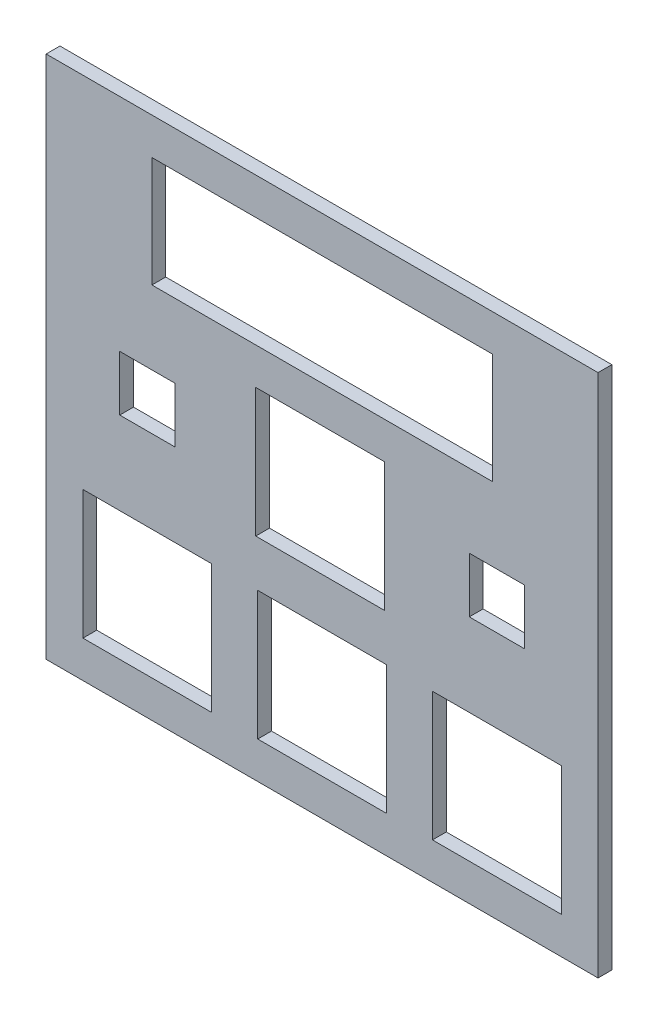
ISO-10303-21;
HEADER;
FILE_DESCRIPTION(('STEP AP214'),'2;1');
FILE_NAME('part.step','',(''),(''),'','','');
FILE_SCHEMA(('AUTOMOTIVE_DESIGN { 1 0 10303 214 1 1 1 1 }'));
ENDSEC;
DATA;
#1=APPLICATION_CONTEXT('core data for automotive mechanical design processes');
#2=APPLICATION_PROTOCOL_DEFINITION('international standard','automotive_design',2000,#1);
#3=PRODUCT_CONTEXT('',#1,'mechanical');
#4=PRODUCT('Part','Part','',(#3));
#5=PRODUCT_RELATED_PRODUCT_CATEGORY('part','',(#4));
#6=PRODUCT_DEFINITION_FORMATION('','',#4);
#7=PRODUCT_DEFINITION_CONTEXT('part definition',#1,'design');
#8=PRODUCT_DEFINITION('design','',#6,#7);
#9=PRODUCT_DEFINITION_SHAPE('','',#8);
#10=(LENGTH_UNIT() NAMED_UNIT(*) SI_UNIT(.MILLI.,.METRE.));
#11=(NAMED_UNIT(*) PLANE_ANGLE_UNIT() SI_UNIT($,.RADIAN.));
#12=(NAMED_UNIT(*) SI_UNIT($,.STERADIAN.) SOLID_ANGLE_UNIT());
#13=UNCERTAINTY_MEASURE_WITH_UNIT(LENGTH_MEASURE(1.E-05),#10,'distance_accuracy_value','');
#14=(GEOMETRIC_REPRESENTATION_CONTEXT(3) GLOBAL_UNCERTAINTY_ASSIGNED_CONTEXT((#13)) GLOBAL_UNIT_ASSIGNED_CONTEXT((#10,
#11,#12)) REPRESENTATION_CONTEXT('',''));
#15=CARTESIAN_POINT('',(0.,0.,0.));
#16=DIRECTION('',(0.,0.,1.));
#17=DIRECTION('',(1.,0.,0.));
#18=AXIS2_PLACEMENT_3D('',#15,#16,#17);
#19=CARTESIAN_POINT('',(0.,0.,1.5));
#20=DIRECTION('',(0.,0.,1.));
#21=DIRECTION('',(1.,0.,0.));
#22=AXIS2_PLACEMENT_3D('',#19,#20,#21);
#23=PLANE('',#22);
#24=DIRECTION('',(0.,-1.,0.));
#25=VECTOR('',#24,1.);
#26=CARTESIAN_POINT('',(-29.7000317126136,15.8414634146342,1.5));
#27=LINE('',#26,#25);
#28=CARTESIAN_POINT('',(-29.7000317126136,15.8414634146342,1.5));
#29=VERTEX_POINT('',#28);
#30=CARTESIAN_POINT('',(-29.7000317126135,-41.1585365853659,1.5));
#31=VERTEX_POINT('',#30);
#32=EDGE_CURVE('E464',#29,#31,#27,.T.);
#33=ORIENTED_EDGE('',*,*,#32,.T.);
#34=DIRECTION('',(1.,0.,0.));
#35=VECTOR('',#34,1.);
#36=CARTESIAN_POINT('',(-29.7000317126135,-41.1585365853659,1.5));
#37=LINE('',#36,#35);
#38=CARTESIAN_POINT('',(30.2999682873865,-41.1585365853658,1.5));
#39=VERTEX_POINT('',#38);
#40=EDGE_CURVE('E467',#31,#39,#37,.T.);
#41=ORIENTED_EDGE('',*,*,#40,.T.);
#42=DIRECTION('',(0.,1.,0.));
#43=VECTOR('',#42,1.);
#44=CARTESIAN_POINT('',(30.2999682873864,15.8414634146342,1.5));
#45=LINE('',#44,#43);
#46=CARTESIAN_POINT('',(30.2999682873864,15.8414634146342,1.5));
#47=VERTEX_POINT('',#46);
#48=EDGE_CURVE('E470',#39,#47,#45,.T.);
#49=ORIENTED_EDGE('',*,*,#48,.T.);
#50=DIRECTION('',(-1.,0.,0.));
#51=VECTOR('',#50,1.);
#52=CARTESIAN_POINT('',(-29.7000317126136,15.8414634146342,1.5));
#53=LINE('',#52,#51);
#54=EDGE_CURVE('E472',#47,#29,#53,.T.);
#55=ORIENTED_EDGE('',*,*,#54,.T.);
#56=EDGE_LOOP('',(#33,#41,#49,#55));
#57=FACE_BOUND('',#56,.T.);
#58=DIRECTION('',(1.,0.,0.));
#59=VECTOR('',#58,1.);
#60=CARTESIAN_POINT('',(-25.7000317126136,-37.1585365853658,1.5));
#61=LINE('',#60,#59);
#62=CARTESIAN_POINT('',(-25.7000317126136,-37.1585365853658,1.5));
#63=VERTEX_POINT('',#62);
#64=CARTESIAN_POINT('',(-11.7000317126135,-37.1585365853658,1.5));
#65=VERTEX_POINT('',#64);
#66=EDGE_CURVE('E435',#63,#65,#61,.T.);
#67=ORIENTED_EDGE('',*,*,#66,.F.);
#68=DIRECTION('',(0.,-1.,0.));
#69=VECTOR('',#68,1.);
#70=CARTESIAN_POINT('',(-25.7000317126136,-37.1585365853658,1.5));
#71=LINE('',#70,#69);
#72=CARTESIAN_POINT('',(-25.7000317126136,-23.1585365853658,1.5));
#73=VERTEX_POINT('',#72);
#74=EDGE_CURVE('E433',#73,#63,#71,.T.);
#75=ORIENTED_EDGE('',*,*,#74,.F.);
#76=DIRECTION('',(-1.,0.,0.));
#77=VECTOR('',#76,1.);
#78=CARTESIAN_POINT('',(-25.7000317126136,-23.1585365853658,1.5));
#79=LINE('',#78,#77);
#80=CARTESIAN_POINT('',(-11.7000317126135,-23.1585365853658,1.5));
#81=VERTEX_POINT('',#80);
#82=EDGE_CURVE('E441',#81,#73,#79,.T.);
#83=ORIENTED_EDGE('',*,*,#82,.F.);
#84=DIRECTION('',(0.,1.,0.));
#85=VECTOR('',#84,1.);
#86=CARTESIAN_POINT('',(-11.7000317126135,-37.1585365853658,1.5));
#87=LINE('',#86,#85);
#88=EDGE_CURVE('E438',#65,#81,#87,.T.);
#89=ORIENTED_EDGE('',*,*,#88,.F.);
#90=EDGE_LOOP('',(#67,#75,#83,#89));
#91=FACE_BOUND('',#90,.T.);
#92=DIRECTION('',(1.,0.,0.));
#93=VECTOR('',#92,1.);
#94=CARTESIAN_POINT('',(-6.70003171261355,-37.1585365853658,1.5));
#95=LINE('',#94,#93);
#96=CARTESIAN_POINT('',(-6.70003171261355,-37.1585365853658,1.5));
#97=VERTEX_POINT('',#96);
#98=CARTESIAN_POINT('',(7.29996828738645,-37.1585365853658,1.5));
#99=VERTEX_POINT('',#98);
#100=EDGE_CURVE('E404',#97,#99,#95,.T.);
#101=ORIENTED_EDGE('',*,*,#100,.F.);
#102=DIRECTION('',(0.,-1.,0.));
#103=VECTOR('',#102,1.);
#104=CARTESIAN_POINT('',(-6.70003171261355,-37.1585365853658,1.5));
#105=LINE('',#104,#103);
#106=CARTESIAN_POINT('',(-6.70003171261355,-23.1585365853658,1.5));
#107=VERTEX_POINT('',#106);
#108=EDGE_CURVE('E402',#107,#97,#105,.T.);
#109=ORIENTED_EDGE('',*,*,#108,.F.);
#110=DIRECTION('',(-1.,0.,0.));
#111=VECTOR('',#110,1.);
#112=CARTESIAN_POINT('',(-6.70003171261355,-23.1585365853658,1.5));
#113=LINE('',#112,#111);
#114=CARTESIAN_POINT('',(7.29996828738645,-23.1585365853658,1.5));
#115=VERTEX_POINT('',#114);
#116=EDGE_CURVE('E410',#115,#107,#113,.T.);
#117=ORIENTED_EDGE('',*,*,#116,.F.);
#118=DIRECTION('',(0.,1.,0.));
#119=VECTOR('',#118,1.);
#120=CARTESIAN_POINT('',(7.29996828738645,-37.1585365853658,1.5));
#121=LINE('',#120,#119);
#122=EDGE_CURVE('E407',#99,#115,#121,.T.);
#123=ORIENTED_EDGE('',*,*,#122,.F.);
#124=EDGE_LOOP('',(#101,#109,#117,#123));
#125=FACE_BOUND('',#124,.T.);
#126=DIRECTION('',(1.,0.,0.));
#127=VECTOR('',#126,1.);
#128=CARTESIAN_POINT('',(12.2999682873865,-37.1585365853659,1.5));
#129=LINE('',#128,#127);
#130=CARTESIAN_POINT('',(12.2999682873865,-37.1585365853659,1.5));
#131=VERTEX_POINT('',#130);
#132=CARTESIAN_POINT('',(26.2999682873865,-37.1585365853659,1.5));
#133=VERTEX_POINT('',#132);
#134=EDGE_CURVE('E373',#131,#133,#129,.T.);
#135=ORIENTED_EDGE('',*,*,#134,.F.);
#136=DIRECTION('',(0.,-1.,0.));
#137=VECTOR('',#136,1.);
#138=CARTESIAN_POINT('',(12.2999682873865,-23.1585365853659,1.5));
#139=LINE('',#138,#137);
#140=CARTESIAN_POINT('',(12.2999682873865,-23.1585365853659,1.5));
#141=VERTEX_POINT('',#140);
#142=EDGE_CURVE('E371',#141,#131,#139,.T.);
#143=ORIENTED_EDGE('',*,*,#142,.F.);
#144=DIRECTION('',(-1.,0.,0.));
#145=VECTOR('',#144,1.);
#146=CARTESIAN_POINT('',(12.2999682873865,-23.1585365853659,1.5));
#147=LINE('',#146,#145);
#148=CARTESIAN_POINT('',(26.2999682873865,-23.1585365853659,1.5));
#149=VERTEX_POINT('',#148);
#150=EDGE_CURVE('E379',#149,#141,#147,.T.);
#151=ORIENTED_EDGE('',*,*,#150,.F.);
#152=DIRECTION('',(0.,1.,0.));
#153=VECTOR('',#152,1.);
#154=CARTESIAN_POINT('',(26.2999682873865,-23.1585365853659,1.5));
#155=LINE('',#154,#153);
#156=EDGE_CURVE('E376',#133,#149,#155,.T.);
#157=ORIENTED_EDGE('',*,*,#156,.F.);
#158=EDGE_LOOP('',(#135,#143,#151,#157));
#159=FACE_BOUND('',#158,.T.);
#160=DIRECTION('',(1.,0.,0.));
#161=VECTOR('',#160,1.);
#162=CARTESIAN_POINT('',(-6.91472683456475,-18.1585365853658,1.5));
#163=LINE('',#162,#161);
#164=CARTESIAN_POINT('',(-6.91472683456475,-18.1585365853658,1.5));
#165=VERTEX_POINT('',#164);
#166=CARTESIAN_POINT('',(7.08527316543525,-18.1585365853658,1.5));
#167=VERTEX_POINT('',#166);
#168=EDGE_CURVE('E342',#165,#167,#163,.T.);
#169=ORIENTED_EDGE('',*,*,#168,.F.);
#170=DIRECTION('',(0.,-1.,0.));
#171=VECTOR('',#170,1.);
#172=CARTESIAN_POINT('',(-6.91472683456475,-18.1585365853658,1.5));
#173=LINE('',#172,#171);
#174=CARTESIAN_POINT('',(-6.91472683456475,-4.15853658536585,1.5));
#175=VERTEX_POINT('',#174);
#176=EDGE_CURVE('E340',#175,#165,#173,.T.);
#177=ORIENTED_EDGE('',*,*,#176,.F.);
#178=DIRECTION('',(-1.,0.,0.));
#179=VECTOR('',#178,1.);
#180=CARTESIAN_POINT('',(-6.91472683456475,-4.15853658536585,1.5));
#181=LINE('',#180,#179);
#182=CARTESIAN_POINT('',(7.08527316543525,-4.15853658536585,1.5));
#183=VERTEX_POINT('',#182);
#184=EDGE_CURVE('E348',#183,#175,#181,.T.);
#185=ORIENTED_EDGE('',*,*,#184,.F.);
#186=DIRECTION('',(0.,1.,0.));
#187=VECTOR('',#186,1.);
#188=CARTESIAN_POINT('',(7.08527316543525,-18.1585365853658,1.5));
#189=LINE('',#188,#187);
#190=EDGE_CURVE('E345',#167,#183,#189,.T.);
#191=ORIENTED_EDGE('',*,*,#190,.F.);
#192=EDGE_LOOP('',(#169,#177,#185,#191));
#193=FACE_BOUND('',#192,.T.);
#194=DIRECTION('',(1.,0.,0.));
#195=VECTOR('',#194,1.);
#196=CARTESIAN_POINT('',(-18.2000317126136,-0.158536585365847,1.5));
#197=LINE('',#196,#195);
#198=CARTESIAN_POINT('',(-18.2000317126136,-0.158536585365847,1.5));
#199=VERTEX_POINT('',#198);
#200=CARTESIAN_POINT('',(18.7999682873865,-0.158536585365847,1.5));
#201=VERTEX_POINT('',#200);
#202=EDGE_CURVE('E311',#199,#201,#197,.T.);
#203=ORIENTED_EDGE('',*,*,#202,.F.);
#204=DIRECTION('',(0.,-1.,0.));
#205=VECTOR('',#204,1.);
#206=CARTESIAN_POINT('',(-18.2000317126136,11.8414634146342,1.5));
#207=LINE('',#206,#205);
#208=CARTESIAN_POINT('',(-18.2000317126136,11.8414634146342,1.5));
#209=VERTEX_POINT('',#208);
#210=EDGE_CURVE('E309',#209,#199,#207,.T.);
#211=ORIENTED_EDGE('',*,*,#210,.F.);
#212=DIRECTION('',(-1.,0.,0.));
#213=VECTOR('',#212,1.);
#214=CARTESIAN_POINT('',(-18.2000317126136,11.8414634146342,1.5));
#215=LINE('',#214,#213);
#216=CARTESIAN_POINT('',(18.7999682873864,11.8414634146342,1.5));
#217=VERTEX_POINT('',#216);
#218=EDGE_CURVE('E317',#217,#209,#215,.T.);
#219=ORIENTED_EDGE('',*,*,#218,.F.);
#220=DIRECTION('',(0.,1.,0.));
#221=VECTOR('',#220,1.);
#222=CARTESIAN_POINT('',(18.7999682873864,11.8414634146342,1.5));
#223=LINE('',#222,#221);
#224=EDGE_CURVE('E314',#201,#217,#223,.T.);
#225=ORIENTED_EDGE('',*,*,#224,.F.);
#226=EDGE_LOOP('',(#203,#211,#219,#225));
#227=FACE_BOUND('',#226,.T.);
#228=DIRECTION('',(1.,0.,0.));
#229=VECTOR('',#228,1.);
#230=CARTESIAN_POINT('',(-21.7000317126135,-14.1585365853658,1.5));
#231=LINE('',#230,#229);
#232=CARTESIAN_POINT('',(-21.7000317126135,-14.1585365853658,1.5));
#233=VERTEX_POINT('',#232);
#234=CARTESIAN_POINT('',(-15.7000317126135,-14.1585365853658,1.5));
#235=VERTEX_POINT('',#234);
#236=EDGE_CURVE('E280',#233,#235,#231,.T.);
#237=ORIENTED_EDGE('',*,*,#236,.F.);
#238=DIRECTION('',(0.,-1.,0.));
#239=VECTOR('',#238,1.);
#240=CARTESIAN_POINT('',(-21.7000317126135,-8.15853658536584,1.5));
#241=LINE('',#240,#239);
#242=CARTESIAN_POINT('',(-21.7000317126135,-8.15853658536584,1.5));
#243=VERTEX_POINT('',#242);
#244=EDGE_CURVE('E278',#243,#233,#241,.T.);
#245=ORIENTED_EDGE('',*,*,#244,.F.);
#246=DIRECTION('',(-1.,0.,0.));
#247=VECTOR('',#246,1.);
#248=CARTESIAN_POINT('',(-21.7000317126135,-8.15853658536584,1.5));
#249=LINE('',#248,#247);
#250=CARTESIAN_POINT('',(-15.7000317126135,-8.15853658536584,1.5));
#251=VERTEX_POINT('',#250);
#252=EDGE_CURVE('E286',#251,#243,#249,.T.);
#253=ORIENTED_EDGE('',*,*,#252,.F.);
#254=DIRECTION('',(0.,1.,0.));
#255=VECTOR('',#254,1.);
#256=CARTESIAN_POINT('',(-15.7000317126135,-8.15853658536584,1.5));
#257=LINE('',#256,#255);
#258=EDGE_CURVE('E283',#235,#251,#257,.T.);
#259=ORIENTED_EDGE('',*,*,#258,.F.);
#260=EDGE_LOOP('',(#237,#245,#253,#259));
#261=FACE_BOUND('',#260,.T.);
#262=DIRECTION('',(1.,0.,0.));
#263=VECTOR('',#262,1.);
#264=CARTESIAN_POINT('',(16.2999682873865,-14.1585365853658,1.5));
#265=LINE('',#264,#263);
#266=CARTESIAN_POINT('',(16.2999682873865,-14.1585365853658,1.5));
#267=VERTEX_POINT('',#266);
#268=CARTESIAN_POINT('',(22.2999682873865,-14.1585365853658,1.5));
#269=VERTEX_POINT('',#268);
#270=EDGE_CURVE('E250',#267,#269,#265,.T.);
#271=ORIENTED_EDGE('',*,*,#270,.F.);
#272=DIRECTION('',(0.,-1.,0.));
#273=VECTOR('',#272,1.);
#274=CARTESIAN_POINT('',(16.2999682873865,-14.1585365853658,1.5));
#275=LINE('',#274,#273);
#276=CARTESIAN_POINT('',(16.2999682873865,-8.15853658536584,1.5));
#277=VERTEX_POINT('',#276);
#278=EDGE_CURVE('E242',#277,#267,#275,.T.);
#279=ORIENTED_EDGE('',*,*,#278,.F.);
#280=DIRECTION('',(-1.,0.,0.));
#281=VECTOR('',#280,1.);
#282=CARTESIAN_POINT('',(16.2999682873865,-8.15853658536584,1.5));
#283=LINE('',#282,#281);
#284=CARTESIAN_POINT('',(22.2999682873865,-8.15853658536584,1.5));
#285=VERTEX_POINT('',#284);
#286=EDGE_CURVE('E264',#285,#277,#283,.T.);
#287=ORIENTED_EDGE('',*,*,#286,.F.);
#288=DIRECTION('',(0.,1.,0.));
#289=VECTOR('',#288,1.);
#290=CARTESIAN_POINT('',(22.2999682873865,-14.1585365853658,1.5));
#291=LINE('',#290,#289);
#292=EDGE_CURVE('E262',#269,#285,#291,.T.);
#293=ORIENTED_EDGE('',*,*,#292,.F.);
#294=EDGE_LOOP('',(#271,#279,#287,#293));
#295=FACE_BOUND('',#294,.T.);
#296=ADVANCED_FACE('F33',(#57,#91,#125,#159,#193,#227,#261,#295),#23,.T.);
#297=CARTESIAN_POINT('',(0.,0.,0.));
#298=DIRECTION('',(0.,0.,1.));
#299=DIRECTION('',(1.,0.,0.));
#300=AXIS2_PLACEMENT_3D('',#297,#298,#299);
#301=PLANE('',#300);
#302=DIRECTION('',(0.,-1.,0.));
#303=VECTOR('',#302,1.);
#304=CARTESIAN_POINT('',(-21.7000317126135,-8.15853658536584,0.));
#305=LINE('',#304,#303);
#306=CARTESIAN_POINT('',(-21.7000317126135,-8.15853658536584,0.));
#307=VERTEX_POINT('',#306);
#308=CARTESIAN_POINT('',(-21.7000317126135,-14.1585365853658,0.));
#309=VERTEX_POINT('',#308);
#310=EDGE_CURVE('E258',#307,#309,#305,.T.);
#311=ORIENTED_EDGE('',*,*,#310,.T.);
#312=DIRECTION('',(1.,0.,0.));
#313=VECTOR('',#312,1.);
#314=CARTESIAN_POINT('',(-21.7000317126135,-14.1585365853658,0.));
#315=LINE('',#314,#313);
#316=CARTESIAN_POINT('',(-15.7000317126135,-14.1585365853658,0.));
#317=VERTEX_POINT('',#316);
#318=EDGE_CURVE('E291',#309,#317,#315,.T.);
#319=ORIENTED_EDGE('',*,*,#318,.T.);
#320=DIRECTION('',(0.,1.,0.));
#321=VECTOR('',#320,1.);
#322=CARTESIAN_POINT('',(-15.7000317126135,-8.15853658536584,0.));
#323=LINE('',#322,#321);
#324=CARTESIAN_POINT('',(-15.7000317126135,-8.15853658536584,0.));
#325=VERTEX_POINT('',#324);
#326=EDGE_CURVE('E294',#317,#325,#323,.T.);
#327=ORIENTED_EDGE('',*,*,#326,.T.);
#328=DIRECTION('',(-1.,0.,0.));
#329=VECTOR('',#328,1.);
#330=CARTESIAN_POINT('',(-21.7000317126135,-8.15853658536584,0.));
#331=LINE('',#330,#329);
#332=EDGE_CURVE('E281',#325,#307,#331,.T.);
#333=ORIENTED_EDGE('',*,*,#332,.T.);
#334=EDGE_LOOP('',(#311,#319,#327,#333));
#335=FACE_BOUND('',#334,.T.);
#336=DIRECTION('',(0.,-1.,0.));
#337=VECTOR('',#336,1.);
#338=CARTESIAN_POINT('',(-6.91472683456475,-18.1585365853658,0.));
#339=LINE('',#338,#337);
#340=CARTESIAN_POINT('',(-6.91472683456475,-4.15853658536585,0.));
#341=VERTEX_POINT('',#340);
#342=CARTESIAN_POINT('',(-6.91472683456475,-18.1585365853658,0.));
#343=VERTEX_POINT('',#342);
#344=EDGE_CURVE('E339',#341,#343,#339,.T.);
#345=ORIENTED_EDGE('',*,*,#344,.T.);
#346=DIRECTION('',(1.,0.,0.));
#347=VECTOR('',#346,1.);
#348=CARTESIAN_POINT('',(-6.91472683456475,-18.1585365853658,0.));
#349=LINE('',#348,#347);
#350=CARTESIAN_POINT('',(7.08527316543525,-18.1585365853658,0.));
#351=VERTEX_POINT('',#350);
#352=EDGE_CURVE('E353',#343,#351,#349,.T.);
#353=ORIENTED_EDGE('',*,*,#352,.T.);
#354=DIRECTION('',(0.,1.,0.));
#355=VECTOR('',#354,1.);
#356=CARTESIAN_POINT('',(7.08527316543525,-18.1585365853658,0.));
#357=LINE('',#356,#355);
#358=CARTESIAN_POINT('',(7.08527316543525,-4.15853658536585,0.));
#359=VERTEX_POINT('',#358);
#360=EDGE_CURVE('E356',#351,#359,#357,.T.);
#361=ORIENTED_EDGE('',*,*,#360,.T.);
#362=DIRECTION('',(-1.,0.,0.));
#363=VECTOR('',#362,1.);
#364=CARTESIAN_POINT('',(-6.91472683456475,-4.15853658536585,0.));
#365=LINE('',#364,#363);
#366=EDGE_CURVE('E343',#359,#341,#365,.T.);
#367=ORIENTED_EDGE('',*,*,#366,.T.);
#368=EDGE_LOOP('',(#345,#353,#361,#367));
#369=FACE_BOUND('',#368,.T.);
#370=DIRECTION('',(0.,-1.,0.));
#371=VECTOR('',#370,1.);
#372=CARTESIAN_POINT('',(-6.70003171261355,-37.1585365853658,0.));
#373=LINE('',#372,#371);
#374=CARTESIAN_POINT('',(-6.70003171261355,-23.1585365853658,0.));
#375=VERTEX_POINT('',#374);
#376=CARTESIAN_POINT('',(-6.70003171261355,-37.1585365853658,0.));
#377=VERTEX_POINT('',#376);
#378=EDGE_CURVE('E401',#375,#377,#373,.T.);
#379=ORIENTED_EDGE('',*,*,#378,.T.);
#380=DIRECTION('',(1.,0.,0.));
#381=VECTOR('',#380,1.);
#382=CARTESIAN_POINT('',(-6.70003171261355,-37.1585365853658,0.));
#383=LINE('',#382,#381);
#384=CARTESIAN_POINT('',(7.29996828738645,-37.1585365853658,0.));
#385=VERTEX_POINT('',#384);
#386=EDGE_CURVE('E415',#377,#385,#383,.T.);
#387=ORIENTED_EDGE('',*,*,#386,.T.);
#388=DIRECTION('',(0.,1.,0.));
#389=VECTOR('',#388,1.);
#390=CARTESIAN_POINT('',(7.29996828738645,-37.1585365853658,0.));
#391=LINE('',#390,#389);
#392=CARTESIAN_POINT('',(7.29996828738645,-23.1585365853658,0.));
#393=VERTEX_POINT('',#392);
#394=EDGE_CURVE('E418',#385,#393,#391,.T.);
#395=ORIENTED_EDGE('',*,*,#394,.T.);
#396=DIRECTION('',(-1.,0.,0.));
#397=VECTOR('',#396,1.);
#398=CARTESIAN_POINT('',(-6.70003171261355,-23.1585365853658,0.));
#399=LINE('',#398,#397);
#400=EDGE_CURVE('E405',#393,#375,#399,.T.);
#401=ORIENTED_EDGE('',*,*,#400,.T.);
#402=EDGE_LOOP('',(#379,#387,#395,#401));
#403=FACE_BOUND('',#402,.T.);
#404=DIRECTION('',(0.,-1.,0.));
#405=VECTOR('',#404,1.);
#406=CARTESIAN_POINT('',(-29.7000317126136,15.8414634146342,0.));
#407=LINE('',#406,#405);
#408=CARTESIAN_POINT('',(-29.7000317126136,15.8414634146342,0.));
#409=VERTEX_POINT('',#408);
#410=CARTESIAN_POINT('',(-29.7000317126135,-41.1585365853659,0.));
#411=VERTEX_POINT('',#410);
#412=EDGE_CURVE('E463',#409,#411,#407,.T.);
#413=ORIENTED_EDGE('',*,*,#412,.F.);
#414=DIRECTION('',(-1.,0.,0.));
#415=VECTOR('',#414,1.);
#416=CARTESIAN_POINT('',(-29.7000317126136,15.8414634146342,0.));
#417=LINE('',#416,#415);
#418=CARTESIAN_POINT('',(30.2999682873864,15.8414634146342,0.));
#419=VERTEX_POINT('',#418);
#420=EDGE_CURVE('E468',#419,#409,#417,.T.);
#421=ORIENTED_EDGE('',*,*,#420,.F.);
#422=DIRECTION('',(0.,1.,0.));
#423=VECTOR('',#422,1.);
#424=CARTESIAN_POINT('',(30.2999682873864,15.8414634146342,0.));
#425=LINE('',#424,#423);
#426=CARTESIAN_POINT('',(30.2999682873865,-41.1585365853658,0.));
#427=VERTEX_POINT('',#426);
#428=EDGE_CURVE('E479',#427,#419,#425,.T.);
#429=ORIENTED_EDGE('',*,*,#428,.F.);
#430=DIRECTION('',(1.,0.,0.));
#431=VECTOR('',#430,1.);
#432=CARTESIAN_POINT('',(-29.7000317126135,-41.1585365853659,0.));
#433=LINE('',#432,#431);
#434=EDGE_CURVE('E477',#411,#427,#433,.T.);
#435=ORIENTED_EDGE('',*,*,#434,.F.);
#436=EDGE_LOOP('',(#413,#421,#429,#435));
#437=FACE_BOUND('',#436,.T.);
#438=DIRECTION('',(0.,-1.,0.));
#439=VECTOR('',#438,1.);
#440=CARTESIAN_POINT('',(-25.7000317126136,-37.1585365853658,0.));
#441=LINE('',#440,#439);
#442=CARTESIAN_POINT('',(-25.7000317126136,-23.1585365853658,0.));
#443=VERTEX_POINT('',#442);
#444=CARTESIAN_POINT('',(-25.7000317126136,-37.1585365853658,0.));
#445=VERTEX_POINT('',#444);
#446=EDGE_CURVE('E432',#443,#445,#441,.T.);
#447=ORIENTED_EDGE('',*,*,#446,.T.);
#448=DIRECTION('',(1.,0.,0.));
#449=VECTOR('',#448,1.);
#450=CARTESIAN_POINT('',(-25.7000317126136,-37.1585365853658,0.));
#451=LINE('',#450,#449);
#452=CARTESIAN_POINT('',(-11.7000317126135,-37.1585365853658,0.));
#453=VERTEX_POINT('',#452);
#454=EDGE_CURVE('E446',#445,#453,#451,.T.);
#455=ORIENTED_EDGE('',*,*,#454,.T.);
#456=DIRECTION('',(0.,1.,0.));
#457=VECTOR('',#456,1.);
#458=CARTESIAN_POINT('',(-11.7000317126135,-37.1585365853658,0.));
#459=LINE('',#458,#457);
#460=CARTESIAN_POINT('',(-11.7000317126135,-23.1585365853658,0.));
#461=VERTEX_POINT('',#460);
#462=EDGE_CURVE('E449',#453,#461,#459,.T.);
#463=ORIENTED_EDGE('',*,*,#462,.T.);
#464=DIRECTION('',(-1.,0.,0.));
#465=VECTOR('',#464,1.);
#466=CARTESIAN_POINT('',(-25.7000317126136,-23.1585365853658,0.));
#467=LINE('',#466,#465);
#468=EDGE_CURVE('E436',#461,#443,#467,.T.);
#469=ORIENTED_EDGE('',*,*,#468,.T.);
#470=EDGE_LOOP('',(#447,#455,#463,#469));
#471=FACE_BOUND('',#470,.T.);
#472=DIRECTION('',(0.,-1.,0.));
#473=VECTOR('',#472,1.);
#474=CARTESIAN_POINT('',(12.2999682873865,-23.1585365853659,0.));
#475=LINE('',#474,#473);
#476=CARTESIAN_POINT('',(12.2999682873865,-23.1585365853659,0.));
#477=VERTEX_POINT('',#476);
#478=CARTESIAN_POINT('',(12.2999682873865,-37.1585365853659,0.));
#479=VERTEX_POINT('',#478);
#480=EDGE_CURVE('E370',#477,#479,#475,.T.);
#481=ORIENTED_EDGE('',*,*,#480,.T.);
#482=DIRECTION('',(1.,0.,0.));
#483=VECTOR('',#482,1.);
#484=CARTESIAN_POINT('',(12.2999682873865,-37.1585365853659,0.));
#485=LINE('',#484,#483);
#486=CARTESIAN_POINT('',(26.2999682873865,-37.1585365853659,0.));
#487=VERTEX_POINT('',#486);
#488=EDGE_CURVE('E384',#479,#487,#485,.T.);
#489=ORIENTED_EDGE('',*,*,#488,.T.);
#490=DIRECTION('',(0.,1.,0.));
#491=VECTOR('',#490,1.);
#492=CARTESIAN_POINT('',(26.2999682873865,-23.1585365853659,0.));
#493=LINE('',#492,#491);
#494=CARTESIAN_POINT('',(26.2999682873865,-23.1585365853659,0.));
#495=VERTEX_POINT('',#494);
#496=EDGE_CURVE('E387',#487,#495,#493,.T.);
#497=ORIENTED_EDGE('',*,*,#496,.T.);
#498=DIRECTION('',(-1.,0.,0.));
#499=VECTOR('',#498,1.);
#500=CARTESIAN_POINT('',(12.2999682873865,-23.1585365853659,0.));
#501=LINE('',#500,#499);
#502=EDGE_CURVE('E374',#495,#477,#501,.T.);
#503=ORIENTED_EDGE('',*,*,#502,.T.);
#504=EDGE_LOOP('',(#481,#489,#497,#503));
#505=FACE_BOUND('',#504,.T.);
#506=DIRECTION('',(0.,-1.,0.));
#507=VECTOR('',#506,1.);
#508=CARTESIAN_POINT('',(-18.2000317126136,11.8414634146342,0.));
#509=LINE('',#508,#507);
#510=CARTESIAN_POINT('',(-18.2000317126136,11.8414634146342,0.));
#511=VERTEX_POINT('',#510);
#512=CARTESIAN_POINT('',(-18.2000317126136,-0.158536585365847,0.));
#513=VERTEX_POINT('',#512);
#514=EDGE_CURVE('E308',#511,#513,#509,.T.);
#515=ORIENTED_EDGE('',*,*,#514,.T.);
#516=DIRECTION('',(1.,0.,0.));
#517=VECTOR('',#516,1.);
#518=CARTESIAN_POINT('',(-18.2000317126136,-0.158536585365847,0.));
#519=LINE('',#518,#517);
#520=CARTESIAN_POINT('',(18.7999682873865,-0.158536585365847,0.));
#521=VERTEX_POINT('',#520);
#522=EDGE_CURVE('E322',#513,#521,#519,.T.);
#523=ORIENTED_EDGE('',*,*,#522,.T.);
#524=DIRECTION('',(0.,1.,0.));
#525=VECTOR('',#524,1.);
#526=CARTESIAN_POINT('',(18.7999682873864,11.8414634146342,0.));
#527=LINE('',#526,#525);
#528=CARTESIAN_POINT('',(18.7999682873864,11.8414634146342,0.));
#529=VERTEX_POINT('',#528);
#530=EDGE_CURVE('E325',#521,#529,#527,.T.);
#531=ORIENTED_EDGE('',*,*,#530,.T.);
#532=DIRECTION('',(-1.,0.,0.));
#533=VECTOR('',#532,1.);
#534=CARTESIAN_POINT('',(-18.2000317126136,11.8414634146342,0.));
#535=LINE('',#534,#533);
#536=EDGE_CURVE('E312',#529,#511,#535,.T.);
#537=ORIENTED_EDGE('',*,*,#536,.T.);
#538=EDGE_LOOP('',(#515,#523,#531,#537));
#539=FACE_BOUND('',#538,.T.);
#540=DIRECTION('',(0.,-1.,0.));
#541=VECTOR('',#540,1.);
#542=CARTESIAN_POINT('',(16.2999682873865,-14.1585365853658,0.));
#543=LINE('',#542,#541);
#544=CARTESIAN_POINT('',(16.2999682873865,-8.15853658536584,0.));
#545=VERTEX_POINT('',#544);
#546=CARTESIAN_POINT('',(16.2999682873865,-14.1585365853658,0.));
#547=VERTEX_POINT('',#546);
#548=EDGE_CURVE('E56',#545,#547,#543,.T.);
#549=ORIENTED_EDGE('',*,*,#548,.T.);
#550=DIRECTION('',(1.,0.,0.));
#551=VECTOR('',#550,1.);
#552=CARTESIAN_POINT('',(16.2999682873865,-14.1585365853658,0.));
#553=LINE('',#552,#551);
#554=CARTESIAN_POINT('',(22.2999682873865,-14.1585365853658,0.));
#555=VERTEX_POINT('',#554);
#556=EDGE_CURVE('E257',#547,#555,#553,.T.);
#557=ORIENTED_EDGE('',*,*,#556,.T.);
#558=DIRECTION('',(0.,1.,0.));
#559=VECTOR('',#558,1.);
#560=CARTESIAN_POINT('',(22.2999682873865,-14.1585365853658,0.));
#561=LINE('',#560,#559);
#562=CARTESIAN_POINT('',(22.2999682873865,-8.15853658536584,0.));
#563=VERTEX_POINT('',#562);
#564=EDGE_CURVE('E270',#555,#563,#561,.T.);
#565=ORIENTED_EDGE('',*,*,#564,.T.);
#566=DIRECTION('',(-1.,0.,0.));
#567=VECTOR('',#566,1.);
#568=CARTESIAN_POINT('',(16.2999682873865,-8.15853658536584,0.));
#569=LINE('',#568,#567);
#570=EDGE_CURVE('E251',#563,#545,#569,.T.);
#571=ORIENTED_EDGE('',*,*,#570,.T.);
#572=EDGE_LOOP('',(#549,#557,#565,#571));
#573=FACE_BOUND('',#572,.T.);
#574=ADVANCED_FACE('F497',(#335,#369,#403,#437,#471,#505,#539,#573),#301,.F.);
#575=CARTESIAN_POINT('',(-29.7000317126136,15.8414634146342,1.5));
#576=DIRECTION('',(1.,0.,0.));
#577=DIRECTION('',(0.,1.,0.));
#578=AXIS2_PLACEMENT_3D('',#575,#576,#577);
#579=PLANE('',#578);
#580=ORIENTED_EDGE('',*,*,#412,.T.);
#581=DIRECTION('',(0.,0.,-1.));
#582=VECTOR('',#581,1.);
#583=CARTESIAN_POINT('',(-29.7000317126135,-41.1585365853659,1.5));
#584=LINE('',#583,#582);
#585=EDGE_CURVE('E11',#31,#411,#584,.T.);
#586=ORIENTED_EDGE('',*,*,#585,.F.);
#587=ORIENTED_EDGE('',*,*,#32,.F.);
#588=DIRECTION('',(0.,0.,-1.));
#589=VECTOR('',#588,1.);
#590=CARTESIAN_POINT('',(-29.7000317126136,15.8414634146342,1.5));
#591=LINE('',#590,#589);
#592=EDGE_CURVE('E474',#29,#409,#591,.T.);
#593=ORIENTED_EDGE('',*,*,#592,.T.);
#594=EDGE_LOOP('',(#580,#586,#587,#593));
#595=FACE_BOUND('',#594,.T.);
#596=ADVANCED_FACE('F35',(#595),#579,.F.);
#597=CARTESIAN_POINT('',(-29.7000317126135,-41.1585365853659,1.5));
#598=DIRECTION('',(0.,1.,0.));
#599=DIRECTION('',(-1.,0.,0.));
#600=AXIS2_PLACEMENT_3D('',#597,#598,#599);
#601=PLANE('',#600);
#602=ORIENTED_EDGE('',*,*,#434,.T.);
#603=DIRECTION('',(0.,0.,-1.));
#604=VECTOR('',#603,1.);
#605=CARTESIAN_POINT('',(30.2999682873865,-41.1585365853658,1.5));
#606=LINE('',#605,#604);
#607=EDGE_CURVE('E41',#39,#427,#606,.T.);
#608=ORIENTED_EDGE('',*,*,#607,.F.);
#609=ORIENTED_EDGE('',*,*,#40,.F.);
#610=ORIENTED_EDGE('',*,*,#585,.T.);
#611=EDGE_LOOP('',(#602,#608,#609,#610));
#612=FACE_BOUND('',#611,.T.);
#613=ADVANCED_FACE('F508',(#612),#601,.F.);
#614=CARTESIAN_POINT('',(30.2999682873864,15.8414634146342,1.5));
#615=DIRECTION('',(-1.,0.,0.));
#616=DIRECTION('',(0.,-1.,0.));
#617=AXIS2_PLACEMENT_3D('',#614,#615,#616);
#618=PLANE('',#617);
#619=ORIENTED_EDGE('',*,*,#428,.T.);
#620=DIRECTION('',(0.,0.,-1.));
#621=VECTOR('',#620,1.);
#622=CARTESIAN_POINT('',(30.2999682873864,15.8414634146342,1.5));
#623=LINE('',#622,#621);
#624=EDGE_CURVE('E484',#47,#419,#623,.T.);
#625=ORIENTED_EDGE('',*,*,#624,.F.);
#626=ORIENTED_EDGE('',*,*,#48,.F.);
#627=ORIENTED_EDGE('',*,*,#607,.T.);
#628=EDGE_LOOP('',(#619,#625,#626,#627));
#629=FACE_BOUND('',#628,.T.);
#630=ADVANCED_FACE('F491',(#629),#618,.F.);
#631=CARTESIAN_POINT('',(-29.7000317126136,15.8414634146342,1.5));
#632=DIRECTION('',(0.,-1.,0.));
#633=DIRECTION('',(1.,0.,0.));
#634=AXIS2_PLACEMENT_3D('',#631,#632,#633);
#635=PLANE('',#634);
#636=ORIENTED_EDGE('',*,*,#420,.T.);
#637=ORIENTED_EDGE('',*,*,#592,.F.);
#638=ORIENTED_EDGE('',*,*,#54,.F.);
#639=ORIENTED_EDGE('',*,*,#624,.T.);
#640=EDGE_LOOP('',(#636,#637,#638,#639));
#641=FACE_BOUND('',#640,.T.);
#642=ADVANCED_FACE('F501',(#641),#635,.F.);
#643=CARTESIAN_POINT('',(-25.7000317126136,-37.1585365853658,1.5));
#644=DIRECTION('',(1.,0.,0.));
#645=DIRECTION('',(0.,0.,-1.));
#646=AXIS2_PLACEMENT_3D('',#643,#644,#645);
#647=PLANE('',#646);
#648=ORIENTED_EDGE('',*,*,#446,.F.);
#649=DIRECTION('',(0.,0.,-1.));
#650=VECTOR('',#649,1.);
#651=CARTESIAN_POINT('',(-25.7000317126136,-23.1585365853658,1.5));
#652=LINE('',#651,#650);
#653=EDGE_CURVE('E443',#73,#443,#652,.T.);
#654=ORIENTED_EDGE('',*,*,#653,.F.);
#655=ORIENTED_EDGE('',*,*,#74,.T.);
#656=DIRECTION('',(0.,0.,-1.));
#657=VECTOR('',#656,1.);
#658=CARTESIAN_POINT('',(-25.7000317126136,-37.1585365853658,1.5));
#659=LINE('',#658,#657);
#660=EDGE_CURVE('E460',#63,#445,#659,.T.);
#661=ORIENTED_EDGE('',*,*,#660,.T.);
#662=EDGE_LOOP('',(#648,#654,#655,#661));
#663=FACE_BOUND('',#662,.T.);
#664=ADVANCED_FACE('F523',(#663),#647,.T.);
#665=CARTESIAN_POINT('',(-25.7000317126136,-37.1585365853658,1.5));
#666=DIRECTION('',(0.,1.,0.));
#667=DIRECTION('',(0.,0.,1.));
#668=AXIS2_PLACEMENT_3D('',#665,#666,#667);
#669=PLANE('',#668);
#670=ORIENTED_EDGE('',*,*,#454,.F.);
#671=ORIENTED_EDGE('',*,*,#660,.F.);
#672=ORIENTED_EDGE('',*,*,#66,.T.);
#673=DIRECTION('',(0.,0.,-1.));
#674=VECTOR('',#673,1.);
#675=CARTESIAN_POINT('',(-11.7000317126135,-37.1585365853658,1.5));
#676=LINE('',#675,#674);
#677=EDGE_CURVE('E458',#65,#453,#676,.T.);
#678=ORIENTED_EDGE('',*,*,#677,.T.);
#679=EDGE_LOOP('',(#670,#671,#672,#678));
#680=FACE_BOUND('',#679,.T.);
#681=ADVANCED_FACE('F530',(#680),#669,.T.);
#682=CARTESIAN_POINT('',(-11.7000317126135,-37.1585365853658,1.5));
#683=DIRECTION('',(-1.,0.,0.));
#684=DIRECTION('',(0.,0.,1.));
#685=AXIS2_PLACEMENT_3D('',#682,#683,#684);
#686=PLANE('',#685);
#687=ORIENTED_EDGE('',*,*,#462,.F.);
#688=ORIENTED_EDGE('',*,*,#677,.F.);
#689=ORIENTED_EDGE('',*,*,#88,.T.);
#690=DIRECTION('',(0.,0.,-1.));
#691=VECTOR('',#690,1.);
#692=CARTESIAN_POINT('',(-11.7000317126135,-23.1585365853658,1.5));
#693=LINE('',#692,#691);
#694=EDGE_CURVE('E456',#81,#461,#693,.T.);
#695=ORIENTED_EDGE('',*,*,#694,.T.);
#696=EDGE_LOOP('',(#687,#688,#689,#695));
#697=FACE_BOUND('',#696,.T.);
#698=ADVANCED_FACE('F535',(#697),#686,.T.);
#699=CARTESIAN_POINT('',(-25.7000317126136,-23.1585365853658,1.5));
#700=DIRECTION('',(0.,-1.,0.));
#701=DIRECTION('',(0.,0.,-1.));
#702=AXIS2_PLACEMENT_3D('',#699,#700,#701);
#703=PLANE('',#702);
#704=ORIENTED_EDGE('',*,*,#468,.F.);
#705=ORIENTED_EDGE('',*,*,#694,.F.);
#706=ORIENTED_EDGE('',*,*,#82,.T.);
#707=ORIENTED_EDGE('',*,*,#653,.T.);
#708=EDGE_LOOP('',(#704,#705,#706,#707));
#709=FACE_BOUND('',#708,.T.);
#710=ADVANCED_FACE('F542',(#709),#703,.T.);
#711=CARTESIAN_POINT('',(-6.70003171261355,-37.1585365853658,1.5));
#712=DIRECTION('',(1.,0.,0.));
#713=DIRECTION('',(0.,0.,-1.));
#714=AXIS2_PLACEMENT_3D('',#711,#712,#713);
#715=PLANE('',#714);
#716=ORIENTED_EDGE('',*,*,#378,.F.);
#717=DIRECTION('',(0.,0.,-1.));
#718=VECTOR('',#717,1.);
#719=CARTESIAN_POINT('',(-6.70003171261355,-23.1585365853658,1.5));
#720=LINE('',#719,#718);
#721=EDGE_CURVE('E412',#107,#375,#720,.T.);
#722=ORIENTED_EDGE('',*,*,#721,.F.);
#723=ORIENTED_EDGE('',*,*,#108,.T.);
#724=DIRECTION('',(0.,0.,-1.));
#725=VECTOR('',#724,1.);
#726=CARTESIAN_POINT('',(-6.70003171261355,-37.1585365853658,1.5));
#727=LINE('',#726,#725);
#728=EDGE_CURVE('E429',#97,#377,#727,.T.);
#729=ORIENTED_EDGE('',*,*,#728,.T.);
#730=EDGE_LOOP('',(#716,#722,#723,#729));
#731=FACE_BOUND('',#730,.T.);
#732=ADVANCED_FACE('F658',(#731),#715,.T.);
#733=CARTESIAN_POINT('',(-6.70003171261355,-37.1585365853658,1.5));
#734=DIRECTION('',(0.,1.,0.));
#735=DIRECTION('',(0.,0.,1.));
#736=AXIS2_PLACEMENT_3D('',#733,#734,#735);
#737=PLANE('',#736);
#738=ORIENTED_EDGE('',*,*,#386,.F.);
#739=ORIENTED_EDGE('',*,*,#728,.F.);
#740=ORIENTED_EDGE('',*,*,#100,.T.);
#741=DIRECTION('',(0.,0.,-1.));
#742=VECTOR('',#741,1.);
#743=CARTESIAN_POINT('',(7.29996828738645,-37.1585365853658,1.5));
#744=LINE('',#743,#742);
#745=EDGE_CURVE('E427',#99,#385,#744,.T.);
#746=ORIENTED_EDGE('',*,*,#745,.T.);
#747=EDGE_LOOP('',(#738,#739,#740,#746));
#748=FACE_BOUND('',#747,.T.);
#749=ADVANCED_FACE('F654',(#748),#737,.T.);
#750=CARTESIAN_POINT('',(7.29996828738645,-37.1585365853658,1.5));
#751=DIRECTION('',(-1.,0.,0.));
#752=DIRECTION('',(0.,0.,1.));
#753=AXIS2_PLACEMENT_3D('',#750,#751,#752);
#754=PLANE('',#753);
#755=ORIENTED_EDGE('',*,*,#394,.F.);
#756=ORIENTED_EDGE('',*,*,#745,.F.);
#757=ORIENTED_EDGE('',*,*,#122,.T.);
#758=DIRECTION('',(0.,0.,-1.));
#759=VECTOR('',#758,1.);
#760=CARTESIAN_POINT('',(7.29996828738645,-23.1585365853658,1.5));
#761=LINE('',#760,#759);
#762=EDGE_CURVE('E425',#115,#393,#761,.T.);
#763=ORIENTED_EDGE('',*,*,#762,.T.);
#764=EDGE_LOOP('',(#755,#756,#757,#763));
#765=FACE_BOUND('',#764,.T.);
#766=ADVANCED_FACE('F650',(#765),#754,.T.);
#767=CARTESIAN_POINT('',(-6.70003171261355,-23.1585365853658,1.5));
#768=DIRECTION('',(0.,-1.,0.));
#769=DIRECTION('',(0.,0.,-1.));
#770=AXIS2_PLACEMENT_3D('',#767,#768,#769);
#771=PLANE('',#770);
#772=ORIENTED_EDGE('',*,*,#400,.F.);
#773=ORIENTED_EDGE('',*,*,#762,.F.);
#774=ORIENTED_EDGE('',*,*,#116,.T.);
#775=ORIENTED_EDGE('',*,*,#721,.T.);
#776=EDGE_LOOP('',(#772,#773,#774,#775));
#777=FACE_BOUND('',#776,.T.);
#778=ADVANCED_FACE('F646',(#777),#771,.T.);
#779=CARTESIAN_POINT('',(12.2999682873865,-23.1585365853659,1.5));
#780=DIRECTION('',(1.,0.,0.));
#781=DIRECTION('',(0.,1.,0.));
#782=AXIS2_PLACEMENT_3D('',#779,#780,#781);
#783=PLANE('',#782);
#784=ORIENTED_EDGE('',*,*,#480,.F.);
#785=DIRECTION('',(0.,0.,-1.));
#786=VECTOR('',#785,1.);
#787=CARTESIAN_POINT('',(12.2999682873865,-23.1585365853659,1.5));
#788=LINE('',#787,#786);
#789=EDGE_CURVE('E381',#141,#477,#788,.T.);
#790=ORIENTED_EDGE('',*,*,#789,.F.);
#791=ORIENTED_EDGE('',*,*,#142,.T.);
#792=DIRECTION('',(0.,0.,-1.));
#793=VECTOR('',#792,1.);
#794=CARTESIAN_POINT('',(12.2999682873865,-37.1585365853659,1.5));
#795=LINE('',#794,#793);
#796=EDGE_CURVE('E398',#131,#479,#795,.T.);
#797=ORIENTED_EDGE('',*,*,#796,.T.);
#798=EDGE_LOOP('',(#784,#790,#791,#797));
#799=FACE_BOUND('',#798,.T.);
#800=ADVANCED_FACE('F642',(#799),#783,.T.);
#801=CARTESIAN_POINT('',(12.2999682873865,-37.1585365853659,1.5));
#802=DIRECTION('',(0.,1.,0.));
#803=DIRECTION('',(0.,0.,1.));
#804=AXIS2_PLACEMENT_3D('',#801,#802,#803);
#805=PLANE('',#804);
#806=ORIENTED_EDGE('',*,*,#488,.F.);
#807=ORIENTED_EDGE('',*,*,#796,.F.);
#808=ORIENTED_EDGE('',*,*,#134,.T.);
#809=DIRECTION('',(0.,0.,-1.));
#810=VECTOR('',#809,1.);
#811=CARTESIAN_POINT('',(26.2999682873865,-37.1585365853659,1.5));
#812=LINE('',#811,#810);
#813=EDGE_CURVE('E396',#133,#487,#812,.T.);
#814=ORIENTED_EDGE('',*,*,#813,.T.);
#815=EDGE_LOOP('',(#806,#807,#808,#814));
#816=FACE_BOUND('',#815,.T.);
#817=ADVANCED_FACE('F638',(#816),#805,.T.);
#818=CARTESIAN_POINT('',(26.2999682873865,-23.1585365853659,1.5));
#819=DIRECTION('',(-1.,0.,0.));
#820=DIRECTION('',(0.,0.,1.));
#821=AXIS2_PLACEMENT_3D('',#818,#819,#820);
#822=PLANE('',#821);
#823=ORIENTED_EDGE('',*,*,#496,.F.);
#824=ORIENTED_EDGE('',*,*,#813,.F.);
#825=ORIENTED_EDGE('',*,*,#156,.T.);
#826=DIRECTION('',(0.,0.,-1.));
#827=VECTOR('',#826,1.);
#828=CARTESIAN_POINT('',(26.2999682873865,-23.1585365853659,1.5));
#829=LINE('',#828,#827);
#830=EDGE_CURVE('E394',#149,#495,#829,.T.);
#831=ORIENTED_EDGE('',*,*,#830,.T.);
#832=EDGE_LOOP('',(#823,#824,#825,#831));
#833=FACE_BOUND('',#832,.T.);
#834=ADVANCED_FACE('F634',(#833),#822,.T.);
#835=CARTESIAN_POINT('',(12.2999682873865,-23.1585365853659,1.5));
#836=DIRECTION('',(0.,-1.,0.));
#837=DIRECTION('',(0.,0.,-1.));
#838=AXIS2_PLACEMENT_3D('',#835,#836,#837);
#839=PLANE('',#838);
#840=ORIENTED_EDGE('',*,*,#502,.F.);
#841=ORIENTED_EDGE('',*,*,#830,.F.);
#842=ORIENTED_EDGE('',*,*,#150,.T.);
#843=ORIENTED_EDGE('',*,*,#789,.T.);
#844=EDGE_LOOP('',(#840,#841,#842,#843));
#845=FACE_BOUND('',#844,.T.);
#846=ADVANCED_FACE('F630',(#845),#839,.T.);
#847=CARTESIAN_POINT('',(-6.91472683456475,-18.1585365853658,1.5));
#848=DIRECTION('',(1.,0.,0.));
#849=DIRECTION('',(0.,0.,-1.));
#850=AXIS2_PLACEMENT_3D('',#847,#848,#849);
#851=PLANE('',#850);
#852=ORIENTED_EDGE('',*,*,#344,.F.);
#853=DIRECTION('',(0.,0.,-1.));
#854=VECTOR('',#853,1.);
#855=CARTESIAN_POINT('',(-6.91472683456475,-4.15853658536585,1.5));
#856=LINE('',#855,#854);
#857=EDGE_CURVE('E350',#175,#341,#856,.T.);
#858=ORIENTED_EDGE('',*,*,#857,.F.);
#859=ORIENTED_EDGE('',*,*,#176,.T.);
#860=DIRECTION('',(0.,0.,-1.));
#861=VECTOR('',#860,1.);
#862=CARTESIAN_POINT('',(-6.91472683456475,-18.1585365853658,1.5));
#863=LINE('',#862,#861);
#864=EDGE_CURVE('E367',#165,#343,#863,.T.);
#865=ORIENTED_EDGE('',*,*,#864,.T.);
#866=EDGE_LOOP('',(#852,#858,#859,#865));
#867=FACE_BOUND('',#866,.T.);
#868=ADVANCED_FACE('F626',(#867),#851,.T.);
#869=CARTESIAN_POINT('',(-6.91472683456475,-18.1585365853658,1.5));
#870=DIRECTION('',(0.,1.,0.));
#871=DIRECTION('',(0.,0.,1.));
#872=AXIS2_PLACEMENT_3D('',#869,#870,#871);
#873=PLANE('',#872);
#874=ORIENTED_EDGE('',*,*,#352,.F.);
#875=ORIENTED_EDGE('',*,*,#864,.F.);
#876=ORIENTED_EDGE('',*,*,#168,.T.);
#877=DIRECTION('',(0.,0.,-1.));
#878=VECTOR('',#877,1.);
#879=CARTESIAN_POINT('',(7.08527316543525,-18.1585365853658,1.5));
#880=LINE('',#879,#878);
#881=EDGE_CURVE('E365',#167,#351,#880,.T.);
#882=ORIENTED_EDGE('',*,*,#881,.T.);
#883=EDGE_LOOP('',(#874,#875,#876,#882));
#884=FACE_BOUND('',#883,.T.);
#885=ADVANCED_FACE('F622',(#884),#873,.T.);
#886=CARTESIAN_POINT('',(7.08527316543525,-18.1585365853658,1.5));
#887=DIRECTION('',(-1.,0.,0.));
#888=DIRECTION('',(0.,0.,1.));
#889=AXIS2_PLACEMENT_3D('',#886,#887,#888);
#890=PLANE('',#889);
#891=ORIENTED_EDGE('',*,*,#360,.F.);
#892=ORIENTED_EDGE('',*,*,#881,.F.);
#893=ORIENTED_EDGE('',*,*,#190,.T.);
#894=DIRECTION('',(0.,0.,-1.));
#895=VECTOR('',#894,1.);
#896=CARTESIAN_POINT('',(7.08527316543525,-4.15853658536585,1.5));
#897=LINE('',#896,#895);
#898=EDGE_CURVE('E363',#183,#359,#897,.T.);
#899=ORIENTED_EDGE('',*,*,#898,.T.);
#900=EDGE_LOOP('',(#891,#892,#893,#899));
#901=FACE_BOUND('',#900,.T.);
#902=ADVANCED_FACE('F618',(#901),#890,.T.);
#903=CARTESIAN_POINT('',(-6.91472683456475,-4.15853658536585,1.5));
#904=DIRECTION('',(0.,-1.,0.));
#905=DIRECTION('',(0.,0.,-1.));
#906=AXIS2_PLACEMENT_3D('',#903,#904,#905);
#907=PLANE('',#906);
#908=ORIENTED_EDGE('',*,*,#366,.F.);
#909=ORIENTED_EDGE('',*,*,#898,.F.);
#910=ORIENTED_EDGE('',*,*,#184,.T.);
#911=ORIENTED_EDGE('',*,*,#857,.T.);
#912=EDGE_LOOP('',(#908,#909,#910,#911));
#913=FACE_BOUND('',#912,.T.);
#914=ADVANCED_FACE('F614',(#913),#907,.T.);
#915=CARTESIAN_POINT('',(-18.2000317126136,11.8414634146342,1.5));
#916=DIRECTION('',(1.,0.,0.));
#917=DIRECTION('',(0.,0.,-1.));
#918=AXIS2_PLACEMENT_3D('',#915,#916,#917);
#919=PLANE('',#918);
#920=ORIENTED_EDGE('',*,*,#514,.F.);
#921=DIRECTION('',(0.,0.,-1.));
#922=VECTOR('',#921,1.);
#923=CARTESIAN_POINT('',(-18.2000317126136,11.8414634146342,1.5));
#924=LINE('',#923,#922);
#925=EDGE_CURVE('E319',#209,#511,#924,.T.);
#926=ORIENTED_EDGE('',*,*,#925,.F.);
#927=ORIENTED_EDGE('',*,*,#210,.T.);
#928=DIRECTION('',(0.,0.,-1.));
#929=VECTOR('',#928,1.);
#930=CARTESIAN_POINT('',(-18.2000317126136,-0.158536585365847,1.5));
#931=LINE('',#930,#929);
#932=EDGE_CURVE('E336',#199,#513,#931,.T.);
#933=ORIENTED_EDGE('',*,*,#932,.T.);
#934=EDGE_LOOP('',(#920,#926,#927,#933));
#935=FACE_BOUND('',#934,.T.);
#936=ADVANCED_FACE('F610',(#935),#919,.T.);
#937=CARTESIAN_POINT('',(-18.2000317126136,-0.158536585365847,1.5));
#938=DIRECTION('',(0.,1.,0.));
#939=DIRECTION('',(0.,0.,1.));
#940=AXIS2_PLACEMENT_3D('',#937,#938,#939);
#941=PLANE('',#940);
#942=ORIENTED_EDGE('',*,*,#522,.F.);
#943=ORIENTED_EDGE('',*,*,#932,.F.);
#944=ORIENTED_EDGE('',*,*,#202,.T.);
#945=DIRECTION('',(0.,0.,-1.));
#946=VECTOR('',#945,1.);
#947=CARTESIAN_POINT('',(18.7999682873865,-0.158536585365847,1.5));
#948=LINE('',#947,#946);
#949=EDGE_CURVE('E334',#201,#521,#948,.T.);
#950=ORIENTED_EDGE('',*,*,#949,.T.);
#951=EDGE_LOOP('',(#942,#943,#944,#950));
#952=FACE_BOUND('',#951,.T.);
#953=ADVANCED_FACE('F606',(#952),#941,.T.);
#954=CARTESIAN_POINT('',(18.7999682873864,11.8414634146342,1.5));
#955=DIRECTION('',(-1.,0.,0.));
#956=DIRECTION('',(0.,-1.,0.));
#957=AXIS2_PLACEMENT_3D('',#954,#955,#956);
#958=PLANE('',#957);
#959=ORIENTED_EDGE('',*,*,#530,.F.);
#960=ORIENTED_EDGE('',*,*,#949,.F.);
#961=ORIENTED_EDGE('',*,*,#224,.T.);
#962=DIRECTION('',(0.,0.,-1.));
#963=VECTOR('',#962,1.);
#964=CARTESIAN_POINT('',(18.7999682873864,11.8414634146342,1.5));
#965=LINE('',#964,#963);
#966=EDGE_CURVE('E332',#217,#529,#965,.T.);
#967=ORIENTED_EDGE('',*,*,#966,.T.);
#968=EDGE_LOOP('',(#959,#960,#961,#967));
#969=FACE_BOUND('',#968,.T.);
#970=ADVANCED_FACE('F602',(#969),#958,.T.);
#971=CARTESIAN_POINT('',(-18.2000317126136,11.8414634146342,1.5));
#972=DIRECTION('',(0.,-1.,0.));
#973=DIRECTION('',(0.,0.,-1.));
#974=AXIS2_PLACEMENT_3D('',#971,#972,#973);
#975=PLANE('',#974);
#976=ORIENTED_EDGE('',*,*,#536,.F.);
#977=ORIENTED_EDGE('',*,*,#966,.F.);
#978=ORIENTED_EDGE('',*,*,#218,.T.);
#979=ORIENTED_EDGE('',*,*,#925,.T.);
#980=EDGE_LOOP('',(#976,#977,#978,#979));
#981=FACE_BOUND('',#980,.T.);
#982=ADVANCED_FACE('F599',(#981),#975,.T.);
#983=CARTESIAN_POINT('',(-21.7000317126135,-8.15853658536584,1.5));
#984=DIRECTION('',(1.,0.,0.));
#985=DIRECTION('',(0.,0.,-1.));
#986=AXIS2_PLACEMENT_3D('',#983,#984,#985);
#987=PLANE('',#986);
#988=ORIENTED_EDGE('',*,*,#310,.F.);
#989=DIRECTION('',(0.,0.,-1.));
#990=VECTOR('',#989,1.);
#991=CARTESIAN_POINT('',(-21.7000317126135,-8.15853658536584,1.5));
#992=LINE('',#991,#990);
#993=EDGE_CURVE('E288',#243,#307,#992,.T.);
#994=ORIENTED_EDGE('',*,*,#993,.F.);
#995=ORIENTED_EDGE('',*,*,#244,.T.);
#996=DIRECTION('',(0.,0.,-1.));
#997=VECTOR('',#996,1.);
#998=CARTESIAN_POINT('',(-21.7000317126135,-14.1585365853658,1.5));
#999=LINE('',#998,#997);
#1000=EDGE_CURVE('E305',#233,#309,#999,.T.);
#1001=ORIENTED_EDGE('',*,*,#1000,.T.);
#1002=EDGE_LOOP('',(#988,#994,#995,#1001));
#1003=FACE_BOUND('',#1002,.T.);
#1004=ADVANCED_FACE('F581',(#1003),#987,.T.);
#1005=CARTESIAN_POINT('',(-21.7000317126135,-14.1585365853658,1.5));
#1006=DIRECTION('',(0.,1.,0.));
#1007=DIRECTION('',(0.,0.,1.));
#1008=AXIS2_PLACEMENT_3D('',#1005,#1006,#1007);
#1009=PLANE('',#1008);
#1010=ORIENTED_EDGE('',*,*,#318,.F.);
#1011=ORIENTED_EDGE('',*,*,#1000,.F.);
#1012=ORIENTED_EDGE('',*,*,#236,.T.);
#1013=DIRECTION('',(0.,0.,-1.));
#1014=VECTOR('',#1013,1.);
#1015=CARTESIAN_POINT('',(-15.7000317126135,-14.1585365853658,1.5));
#1016=LINE('',#1015,#1014);
#1017=EDGE_CURVE('E303',#235,#317,#1016,.T.);
#1018=ORIENTED_EDGE('',*,*,#1017,.T.);
#1019=EDGE_LOOP('',(#1010,#1011,#1012,#1018));
#1020=FACE_BOUND('',#1019,.T.);
#1021=ADVANCED_FACE('F574',(#1020),#1009,.T.);
#1022=CARTESIAN_POINT('',(-15.7000317126135,-8.15853658536584,1.5));
#1023=DIRECTION('',(-1.,0.,0.));
#1024=DIRECTION('',(0.,0.,1.));
#1025=AXIS2_PLACEMENT_3D('',#1022,#1023,#1024);
#1026=PLANE('',#1025);
#1027=ORIENTED_EDGE('',*,*,#326,.F.);
#1028=ORIENTED_EDGE('',*,*,#1017,.F.);
#1029=ORIENTED_EDGE('',*,*,#258,.T.);
#1030=DIRECTION('',(0.,0.,-1.));
#1031=VECTOR('',#1030,1.);
#1032=CARTESIAN_POINT('',(-15.7000317126135,-8.15853658536584,1.5));
#1033=LINE('',#1032,#1031);
#1034=EDGE_CURVE('E301',#251,#325,#1033,.T.);
#1035=ORIENTED_EDGE('',*,*,#1034,.T.);
#1036=EDGE_LOOP('',(#1027,#1028,#1029,#1035));
#1037=FACE_BOUND('',#1036,.T.);
#1038=ADVANCED_FACE('F577',(#1037),#1026,.T.);
#1039=CARTESIAN_POINT('',(-21.7000317126135,-8.15853658536584,1.5));
#1040=DIRECTION('',(0.,-1.,0.));
#1041=DIRECTION('',(0.,0.,-1.));
#1042=AXIS2_PLACEMENT_3D('',#1039,#1040,#1041);
#1043=PLANE('',#1042);
#1044=ORIENTED_EDGE('',*,*,#332,.F.);
#1045=ORIENTED_EDGE('',*,*,#1034,.F.);
#1046=ORIENTED_EDGE('',*,*,#252,.T.);
#1047=ORIENTED_EDGE('',*,*,#993,.T.);
#1048=EDGE_LOOP('',(#1044,#1045,#1046,#1047));
#1049=FACE_BOUND('',#1048,.T.);
#1050=ADVANCED_FACE('F584',(#1049),#1043,.T.);
#1051=CARTESIAN_POINT('',(16.2999682873865,-14.1585365853658,1.5));
#1052=DIRECTION('',(1.,0.,0.));
#1053=DIRECTION('',(0.,0.,-1.));
#1054=AXIS2_PLACEMENT_3D('',#1051,#1052,#1053);
#1055=PLANE('',#1054);
#1056=ORIENTED_EDGE('',*,*,#548,.F.);
#1057=DIRECTION('',(0.,0.,-1.));
#1058=VECTOR('',#1057,1.);
#1059=CARTESIAN_POINT('',(16.2999682873865,-8.15853658536584,1.5));
#1060=LINE('',#1059,#1058);
#1061=EDGE_CURVE('E246',#277,#545,#1060,.T.);
#1062=ORIENTED_EDGE('',*,*,#1061,.F.);
#1063=ORIENTED_EDGE('',*,*,#278,.T.);
#1064=DIRECTION('',(0.,0.,-1.));
#1065=VECTOR('',#1064,1.);
#1066=CARTESIAN_POINT('',(16.2999682873865,-14.1585365853658,1.5));
#1067=LINE('',#1066,#1065);
#1068=EDGE_CURVE('E245',#267,#547,#1067,.T.);
#1069=ORIENTED_EDGE('',*,*,#1068,.T.);
#1070=EDGE_LOOP('',(#1056,#1062,#1063,#1069));
#1071=FACE_BOUND('',#1070,.T.);
#1072=ADVANCED_FACE('F244',(#1071),#1055,.T.);
#1073=CARTESIAN_POINT('',(16.2999682873865,-14.1585365853658,1.5));
#1074=DIRECTION('',(0.,1.,0.));
#1075=DIRECTION('',(0.,0.,1.));
#1076=AXIS2_PLACEMENT_3D('',#1073,#1074,#1075);
#1077=PLANE('',#1076);
#1078=ORIENTED_EDGE('',*,*,#556,.F.);
#1079=ORIENTED_EDGE('',*,*,#1068,.F.);
#1080=ORIENTED_EDGE('',*,*,#270,.T.);
#1081=DIRECTION('',(0.,0.,-1.));
#1082=VECTOR('',#1081,1.);
#1083=CARTESIAN_POINT('',(22.2999682873865,-14.1585365853658,1.5));
#1084=LINE('',#1083,#1082);
#1085=EDGE_CURVE('E259',#269,#555,#1084,.T.);
#1086=ORIENTED_EDGE('',*,*,#1085,.T.);
#1087=EDGE_LOOP('',(#1078,#1079,#1080,#1086));
#1088=FACE_BOUND('',#1087,.T.);
#1089=ADVANCED_FACE('F254',(#1088),#1077,.T.);
#1090=CARTESIAN_POINT('',(22.2999682873865,-14.1585365853658,1.5));
#1091=DIRECTION('',(-1.,0.,0.));
#1092=DIRECTION('',(0.,0.,1.));
#1093=AXIS2_PLACEMENT_3D('',#1090,#1091,#1092);
#1094=PLANE('',#1093);
#1095=ORIENTED_EDGE('',*,*,#564,.F.);
#1096=ORIENTED_EDGE('',*,*,#1085,.F.);
#1097=ORIENTED_EDGE('',*,*,#292,.T.);
#1098=DIRECTION('',(0.,0.,-1.));
#1099=VECTOR('',#1098,1.);
#1100=CARTESIAN_POINT('',(22.2999682873865,-8.15853658536584,1.5));
#1101=LINE('',#1100,#1099);
#1102=EDGE_CURVE('E48',#285,#563,#1101,.T.);
#1103=ORIENTED_EDGE('',*,*,#1102,.T.);
#1104=EDGE_LOOP('',(#1095,#1096,#1097,#1103));
#1105=FACE_BOUND('',#1104,.T.);
#1106=ADVANCED_FACE('F769',(#1105),#1094,.T.);
#1107=CARTESIAN_POINT('',(16.2999682873865,-8.15853658536584,1.5));
#1108=DIRECTION('',(0.,-1.,0.));
#1109=DIRECTION('',(0.,0.,-1.));
#1110=AXIS2_PLACEMENT_3D('',#1107,#1108,#1109);
#1111=PLANE('',#1110);
#1112=ORIENTED_EDGE('',*,*,#570,.F.);
#1113=ORIENTED_EDGE('',*,*,#1102,.F.);
#1114=ORIENTED_EDGE('',*,*,#286,.T.);
#1115=ORIENTED_EDGE('',*,*,#1061,.T.);
#1116=EDGE_LOOP('',(#1112,#1113,#1114,#1115));
#1117=FACE_BOUND('',#1116,.T.);
#1118=ADVANCED_FACE('F777',(#1117),#1111,.T.);
#1119=CLOSED_SHELL('',(#296,#574,#596,#613,#630,#642,#664,#681,#698,#710,#732,#749,#766,#778,
#800,#817,#834,#846,#868,#885,#902,#914,#936,#953,#970,#982,#1004,#1021,#1038,#1050,#1072,#1089,
#1106,#1118));
#1120=MANIFOLD_SOLID_BREP('B2',#1119);
#1121=ADVANCED_BREP_SHAPE_REPRESENTATION('',(#18,#1120),#14);
#1122=SHAPE_DEFINITION_REPRESENTATION(#9,#1121);
ENDSEC;
END-ISO-10303-21;
